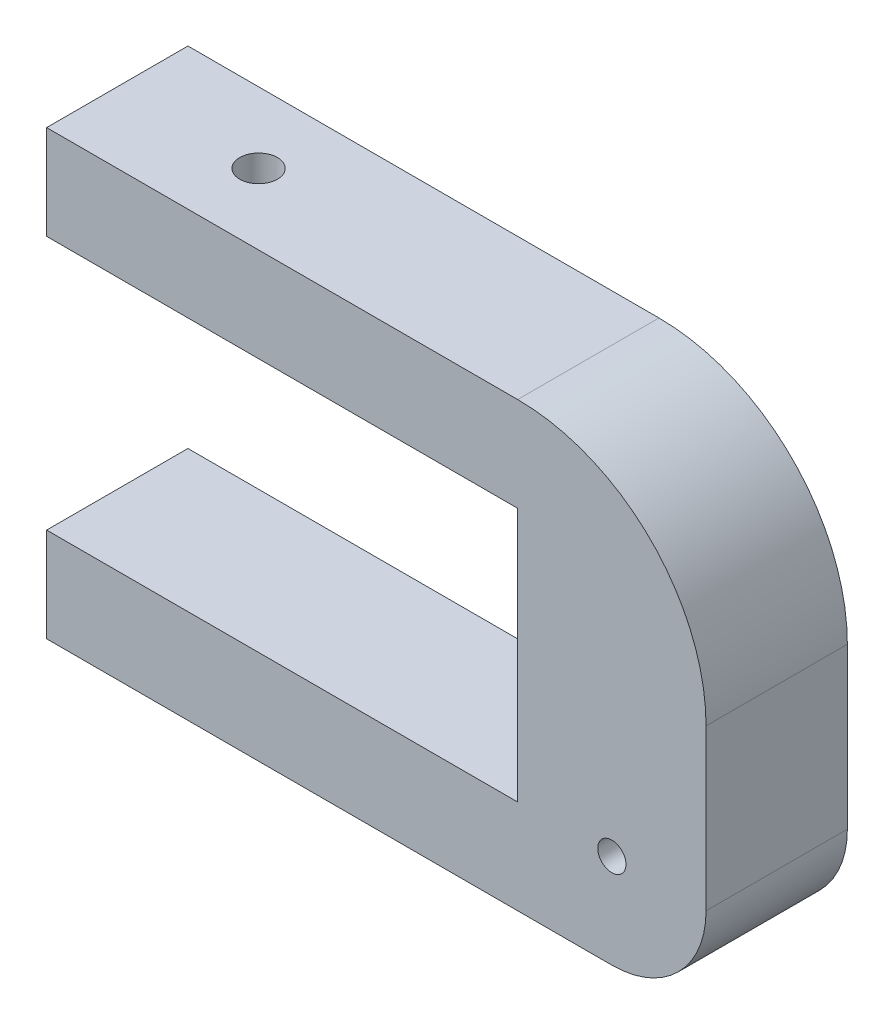
ISO-10303-21;
HEADER;
FILE_DESCRIPTION(('STEP AP214'),'2;1');
FILE_NAME('part.step','',(''),(''),'','','');
FILE_SCHEMA(('AUTOMOTIVE_DESIGN { 1 0 10303 214 1 1 1 1 }'));
ENDSEC;
DATA;
#1=APPLICATION_CONTEXT('core data for automotive mechanical design processes');
#2=APPLICATION_PROTOCOL_DEFINITION('international standard','automotive_design',2000,#1);
#3=PRODUCT_CONTEXT('',#1,'mechanical');
#4=PRODUCT('Part','Part','',(#3));
#5=PRODUCT_RELATED_PRODUCT_CATEGORY('part','',(#4));
#6=PRODUCT_DEFINITION_FORMATION('','',#4);
#7=PRODUCT_DEFINITION_CONTEXT('part definition',#1,'design');
#8=PRODUCT_DEFINITION('design','',#6,#7);
#9=PRODUCT_DEFINITION_SHAPE('','',#8);
#10=(LENGTH_UNIT() NAMED_UNIT(*) SI_UNIT(.MILLI.,.METRE.));
#11=(NAMED_UNIT(*) PLANE_ANGLE_UNIT() SI_UNIT($,.RADIAN.));
#12=(NAMED_UNIT(*) SI_UNIT($,.STERADIAN.) SOLID_ANGLE_UNIT());
#13=UNCERTAINTY_MEASURE_WITH_UNIT(LENGTH_MEASURE(1.E-05),#10,'distance_accuracy_value','');
#14=(GEOMETRIC_REPRESENTATION_CONTEXT(3) GLOBAL_UNCERTAINTY_ASSIGNED_CONTEXT((#13)) GLOBAL_UNIT_ASSIGNED_CONTEXT((#10,
#11,#12)) REPRESENTATION_CONTEXT('',''));
#15=CARTESIAN_POINT('',(0.,0.,0.));
#16=DIRECTION('',(0.,0.,1.));
#17=DIRECTION('',(1.,0.,0.));
#18=AXIS2_PLACEMENT_3D('',#15,#16,#17);
#19=CARTESIAN_POINT('',(50.,-20.,15.));
#20=DIRECTION('',(0.,0.,-1.));
#21=DIRECTION('',(-1.,0.,0.));
#22=AXIS2_PLACEMENT_3D('',#19,#20,#21);
#23=PLANE('',#22);
#24=DIRECTION('',(0.,-1.,0.));
#25=VECTOR('',#24,1.);
#26=CARTESIAN_POINT('',(0.,-10.,15.));
#27=LINE('',#26,#25);
#28=CARTESIAN_POINT('',(0.,0.,15.));
#29=VERTEX_POINT('',#28);
#30=CARTESIAN_POINT('',(0.,-10.,15.));
#31=VERTEX_POINT('',#30);
#32=EDGE_CURVE('E174',#29,#31,#27,.T.);
#33=ORIENTED_EDGE('',*,*,#32,.T.);
#34=DIRECTION('',(1.,0.,0.));
#35=VECTOR('',#34,1.);
#36=CARTESIAN_POINT('',(50.,-9.99999999999999,15.));
#37=LINE('',#36,#35);
#38=CARTESIAN_POINT('',(50.,-9.99999999999999,15.));
#39=VERTEX_POINT('',#38);
#40=EDGE_CURVE('E104',#31,#39,#37,.T.);
#41=ORIENTED_EDGE('',*,*,#40,.T.);
#42=DIRECTION('',(0.,-1.,0.));
#43=VECTOR('',#42,1.);
#44=CARTESIAN_POINT('',(50.,-37.,15.));
#45=LINE('',#44,#43);
#46=CARTESIAN_POINT('',(50.,-37.,15.));
#47=VERTEX_POINT('',#46);
#48=EDGE_CURVE('E196',#39,#47,#45,.T.);
#49=ORIENTED_EDGE('',*,*,#48,.T.);
#50=DIRECTION('',(-1.,0.,0.));
#51=VECTOR('',#50,1.);
#52=CARTESIAN_POINT('',(0.,-37.,15.));
#53=LINE('',#52,#51);
#54=CARTESIAN_POINT('',(0.,-37.,15.));
#55=VERTEX_POINT('',#54);
#56=EDGE_CURVE('E215',#47,#55,#53,.T.);
#57=ORIENTED_EDGE('',*,*,#56,.T.);
#58=DIRECTION('',(0.,-1.,0.));
#59=VECTOR('',#58,1.);
#60=CARTESIAN_POINT('',(0.,-47.,15.));
#61=LINE('',#60,#59);
#62=CARTESIAN_POINT('',(0.,-47.,15.));
#63=VERTEX_POINT('',#62);
#64=EDGE_CURVE('E212',#55,#63,#61,.T.);
#65=ORIENTED_EDGE('',*,*,#64,.T.);
#66=DIRECTION('',(1.,0.,0.));
#67=VECTOR('',#66,1.);
#68=CARTESIAN_POINT('',(0.,-47.,15.));
#69=LINE('',#68,#67);
#70=CARTESIAN_POINT('',(60.,-47.,15.));
#71=VERTEX_POINT('',#70);
#72=EDGE_CURVE('E214',#63,#71,#69,.T.);
#73=ORIENTED_EDGE('',*,*,#72,.T.);
#74=CARTESIAN_POINT('',(60.,-37.,15.));
#75=DIRECTION('',(0.,0.,1.));
#76=DIRECTION('',(-1.,0.,0.));
#77=AXIS2_PLACEMENT_3D('',#74,#75,#76);
#78=CIRCLE('',#77,10.);
#79=CARTESIAN_POINT('',(70.,-37.,15.));
#80=VERTEX_POINT('',#79);
#81=EDGE_CURVE('E133',#71,#80,#78,.T.);
#82=ORIENTED_EDGE('',*,*,#81,.T.);
#83=DIRECTION('',(0.,1.,0.));
#84=VECTOR('',#83,1.);
#85=CARTESIAN_POINT('',(70.,-20.,15.));
#86=LINE('',#85,#84);
#87=CARTESIAN_POINT('',(70.,-20.,15.));
#88=VERTEX_POINT('',#87);
#89=EDGE_CURVE('E126',#80,#88,#86,.T.);
#90=ORIENTED_EDGE('',*,*,#89,.T.);
#91=CARTESIAN_POINT('',(50.,-20.,15.));
#92=DIRECTION('',(0.,0.,1.));
#93=DIRECTION('',(-1.,0.,0.));
#94=AXIS2_PLACEMENT_3D('',#91,#92,#93);
#95=CIRCLE('',#94,20.);
#96=CARTESIAN_POINT('',(50.,0.,15.));
#97=VERTEX_POINT('',#96);
#98=EDGE_CURVE('E130',#88,#97,#95,.T.);
#99=ORIENTED_EDGE('',*,*,#98,.T.);
#100=DIRECTION('',(-1.,0.,0.));
#101=VECTOR('',#100,1.);
#102=CARTESIAN_POINT('',(0.,0.,15.));
#103=LINE('',#102,#101);
#104=EDGE_CURVE('E57',#97,#29,#103,.T.);
#105=ORIENTED_EDGE('',*,*,#104,.T.);
#106=EDGE_LOOP('',(#33,#41,#49,#57,#65,#73,#82,#90,#99,#105));
#107=FACE_BOUND('',#106,.T.);
#108=CARTESIAN_POINT('',(60.,-37.,15.));
#109=DIRECTION('',(0.,0.,1.));
#110=DIRECTION('',(1.,0.,0.));
#111=AXIS2_PLACEMENT_3D('',#108,#109,#110);
#112=CIRCLE('',#111,1.5);
#113=CARTESIAN_POINT('',(61.5,-37.,15.));
#114=VERTEX_POINT('',#113);
#115=EDGE_CURVE('E158',#114,#114,#112,.T.);
#116=ORIENTED_EDGE('',*,*,#115,.F.);
#117=EDGE_LOOP('',(#116));
#118=FACE_BOUND('',#117,.T.);
#119=ADVANCED_FACE('F32',(#107,#118),#23,.F.);
#120=CARTESIAN_POINT('',(50.,-20.,0.));
#121=DIRECTION('',(0.,0.,-1.));
#122=DIRECTION('',(-1.,0.,0.));
#123=AXIS2_PLACEMENT_3D('',#120,#121,#122);
#124=PLANE('',#123);
#125=DIRECTION('',(0.,-1.,0.));
#126=VECTOR('',#125,1.);
#127=CARTESIAN_POINT('',(0.,-10.,0.));
#128=LINE('',#127,#126);
#129=CARTESIAN_POINT('',(0.,0.,0.));
#130=VERTEX_POINT('',#129);
#131=CARTESIAN_POINT('',(0.,-10.,0.));
#132=VERTEX_POINT('',#131);
#133=EDGE_CURVE('E154',#130,#132,#128,.T.);
#134=ORIENTED_EDGE('',*,*,#133,.F.);
#135=DIRECTION('',(-1.,0.,0.));
#136=VECTOR('',#135,1.);
#137=CARTESIAN_POINT('',(0.,0.,0.));
#138=LINE('',#137,#136);
#139=CARTESIAN_POINT('',(50.,0.,0.));
#140=VERTEX_POINT('',#139);
#141=EDGE_CURVE('E96',#140,#130,#138,.T.);
#142=ORIENTED_EDGE('',*,*,#141,.F.);
#143=CARTESIAN_POINT('',(50.,-20.,0.));
#144=DIRECTION('',(0.,0.,1.));
#145=DIRECTION('',(-1.,0.,0.));
#146=AXIS2_PLACEMENT_3D('',#143,#144,#145);
#147=CIRCLE('',#146,20.);
#148=CARTESIAN_POINT('',(70.,-20.,0.));
#149=VERTEX_POINT('',#148);
#150=EDGE_CURVE('E171',#149,#140,#147,.T.);
#151=ORIENTED_EDGE('',*,*,#150,.F.);
#152=DIRECTION('',(0.,1.,0.));
#153=VECTOR('',#152,1.);
#154=CARTESIAN_POINT('',(70.,-20.,0.));
#155=LINE('',#154,#153);
#156=CARTESIAN_POINT('',(70.,-37.,0.));
#157=VERTEX_POINT('',#156);
#158=EDGE_CURVE('E142',#157,#149,#155,.T.);
#159=ORIENTED_EDGE('',*,*,#158,.F.);
#160=CARTESIAN_POINT('',(60.,-37.,0.));
#161=DIRECTION('',(0.,0.,1.));
#162=DIRECTION('',(-1.,0.,0.));
#163=AXIS2_PLACEMENT_3D('',#160,#161,#162);
#164=CIRCLE('',#163,10.);
#165=CARTESIAN_POINT('',(60.,-47.,0.));
#166=VERTEX_POINT('',#165);
#167=EDGE_CURVE('E168',#166,#157,#164,.T.);
#168=ORIENTED_EDGE('',*,*,#167,.F.);
#169=DIRECTION('',(1.,0.,0.));
#170=VECTOR('',#169,1.);
#171=CARTESIAN_POINT('',(0.,-47.,0.));
#172=LINE('',#171,#170);
#173=CARTESIAN_POINT('',(0.,-47.,0.));
#174=VERTEX_POINT('',#173);
#175=EDGE_CURVE('E166',#174,#166,#172,.T.);
#176=ORIENTED_EDGE('',*,*,#175,.F.);
#177=DIRECTION('',(0.,-1.,0.));
#178=VECTOR('',#177,1.);
#179=CARTESIAN_POINT('',(0.,-47.,0.));
#180=LINE('',#179,#178);
#181=CARTESIAN_POINT('',(0.,-37.,0.));
#182=VERTEX_POINT('',#181);
#183=EDGE_CURVE('E164',#182,#174,#180,.T.);
#184=ORIENTED_EDGE('',*,*,#183,.F.);
#185=DIRECTION('',(-1.,0.,0.));
#186=VECTOR('',#185,1.);
#187=CARTESIAN_POINT('',(0.,-37.,0.));
#188=LINE('',#187,#186);
#189=CARTESIAN_POINT('',(50.,-37.,0.));
#190=VERTEX_POINT('',#189);
#191=EDGE_CURVE('E162',#190,#182,#188,.T.);
#192=ORIENTED_EDGE('',*,*,#191,.F.);
#193=DIRECTION('',(0.,-1.,0.));
#194=VECTOR('',#193,1.);
#195=CARTESIAN_POINT('',(50.,-37.,0.));
#196=LINE('',#195,#194);
#197=CARTESIAN_POINT('',(50.,-9.99999999999999,0.));
#198=VERTEX_POINT('',#197);
#199=EDGE_CURVE('E160',#198,#190,#196,.T.);
#200=ORIENTED_EDGE('',*,*,#199,.F.);
#201=DIRECTION('',(1.,0.,0.));
#202=VECTOR('',#201,1.);
#203=CARTESIAN_POINT('',(50.,-9.99999999999999,0.));
#204=LINE('',#203,#202);
#205=EDGE_CURVE('E157',#132,#198,#204,.T.);
#206=ORIENTED_EDGE('',*,*,#205,.F.);
#207=EDGE_LOOP('',(#134,#142,#151,#159,#168,#176,#184,#192,#200,#206));
#208=FACE_BOUND('',#207,.T.);
#209=CARTESIAN_POINT('',(60.,-37.,0.));
#210=DIRECTION('',(0.,0.,1.));
#211=DIRECTION('',(1.,0.,0.));
#212=AXIS2_PLACEMENT_3D('',#209,#210,#211);
#213=CIRCLE('',#212,1.5);
#214=CARTESIAN_POINT('',(61.5,-37.,0.));
#215=VERTEX_POINT('',#214);
#216=EDGE_CURVE('E223',#215,#215,#213,.T.);
#217=ORIENTED_EDGE('',*,*,#216,.T.);
#218=EDGE_LOOP('',(#217));
#219=FACE_BOUND('',#218,.T.);
#220=ADVANCED_FACE('F200',(#208,#219),#124,.T.);
#221=CARTESIAN_POINT('',(0.,-10.,15.));
#222=DIRECTION('',(1.,0.,0.));
#223=DIRECTION('',(0.,0.,-1.));
#224=AXIS2_PLACEMENT_3D('',#221,#222,#223);
#225=PLANE('',#224);
#226=ORIENTED_EDGE('',*,*,#133,.T.);
#227=DIRECTION('',(0.,0.,-1.));
#228=VECTOR('',#227,1.);
#229=CARTESIAN_POINT('',(0.,-10.,15.));
#230=LINE('',#229,#228);
#231=EDGE_CURVE('E11',#31,#132,#230,.T.);
#232=ORIENTED_EDGE('',*,*,#231,.F.);
#233=ORIENTED_EDGE('',*,*,#32,.F.);
#234=DIRECTION('',(0.,0.,-1.));
#235=VECTOR('',#234,1.);
#236=CARTESIAN_POINT('',(0.,0.,15.));
#237=LINE('',#236,#235);
#238=EDGE_CURVE('E150',#29,#130,#237,.T.);
#239=ORIENTED_EDGE('',*,*,#238,.T.);
#240=EDGE_LOOP('',(#226,#232,#233,#239));
#241=FACE_BOUND('',#240,.T.);
#242=ADVANCED_FACE('F34',(#241),#225,.F.);
#243=CARTESIAN_POINT('',(50.,-9.99999999999999,15.));
#244=DIRECTION('',(0.,1.,0.));
#245=DIRECTION('',(-1.,0.,0.));
#246=AXIS2_PLACEMENT_3D('',#243,#244,#245);
#247=PLANE('',#246);
#248=CARTESIAN_POINT('',(15.,-10.,7.5));
#249=DIRECTION('',(0.,-1.,0.));
#250=DIRECTION('',(1.,0.,0.));
#251=AXIS2_PLACEMENT_3D('',#248,#249,#250);
#252=CIRCLE('',#251,5.);
#253=CARTESIAN_POINT('',(20.,-10.,7.5));
#254=VERTEX_POINT('',#253);
#255=EDGE_CURVE('E229',#254,#254,#252,.T.);
#256=ORIENTED_EDGE('',*,*,#255,.F.);
#257=EDGE_LOOP('',(#256));
#258=FACE_BOUND('',#257,.T.);
#259=ORIENTED_EDGE('',*,*,#205,.T.);
#260=DIRECTION('',(0.,0.,-1.));
#261=VECTOR('',#260,1.);
#262=CARTESIAN_POINT('',(50.,-9.99999999999999,15.));
#263=LINE('',#262,#261);
#264=EDGE_CURVE('E41',#39,#198,#263,.T.);
#265=ORIENTED_EDGE('',*,*,#264,.F.);
#266=ORIENTED_EDGE('',*,*,#40,.F.);
#267=ORIENTED_EDGE('',*,*,#231,.T.);
#268=EDGE_LOOP('',(#259,#265,#266,#267));
#269=FACE_BOUND('',#268,.T.);
#270=ADVANCED_FACE('F376',(#258,#269),#247,.F.);
#271=CARTESIAN_POINT('',(50.,-37.,15.));
#272=DIRECTION('',(1.,0.,0.));
#273=DIRECTION('',(0.,0.,-1.));
#274=AXIS2_PLACEMENT_3D('',#271,#272,#273);
#275=PLANE('',#274);
#276=ORIENTED_EDGE('',*,*,#199,.T.);
#277=DIRECTION('',(0.,0.,-1.));
#278=VECTOR('',#277,1.);
#279=CARTESIAN_POINT('',(50.,-37.,15.));
#280=LINE('',#279,#278);
#281=EDGE_CURVE('E187',#47,#190,#280,.T.);
#282=ORIENTED_EDGE('',*,*,#281,.F.);
#283=ORIENTED_EDGE('',*,*,#48,.F.);
#284=ORIENTED_EDGE('',*,*,#264,.T.);
#285=EDGE_LOOP('',(#276,#282,#283,#284));
#286=FACE_BOUND('',#285,.T.);
#287=ADVANCED_FACE('F194',(#286),#275,.F.);
#288=CARTESIAN_POINT('',(0.,-37.,15.));
#289=DIRECTION('',(0.,-1.,0.));
#290=DIRECTION('',(0.,0.,-1.));
#291=AXIS2_PLACEMENT_3D('',#288,#289,#290);
#292=PLANE('',#291);
#293=ORIENTED_EDGE('',*,*,#191,.T.);
#294=DIRECTION('',(0.,0.,-1.));
#295=VECTOR('',#294,1.);
#296=CARTESIAN_POINT('',(0.,-37.,15.));
#297=LINE('',#296,#295);
#298=EDGE_CURVE('E184',#55,#182,#297,.T.);
#299=ORIENTED_EDGE('',*,*,#298,.F.);
#300=ORIENTED_EDGE('',*,*,#56,.F.);
#301=ORIENTED_EDGE('',*,*,#281,.T.);
#302=EDGE_LOOP('',(#293,#299,#300,#301));
#303=FACE_BOUND('',#302,.T.);
#304=ADVANCED_FACE('F206',(#303),#292,.F.);
#305=CARTESIAN_POINT('',(0.,-47.,15.));
#306=DIRECTION('',(1.,0.,0.));
#307=DIRECTION('',(0.,0.,-1.));
#308=AXIS2_PLACEMENT_3D('',#305,#306,#307);
#309=PLANE('',#308);
#310=ORIENTED_EDGE('',*,*,#183,.T.);
#311=DIRECTION('',(0.,0.,-1.));
#312=VECTOR('',#311,1.);
#313=CARTESIAN_POINT('',(0.,-47.,15.));
#314=LINE('',#313,#312);
#315=EDGE_CURVE('E181',#63,#174,#314,.T.);
#316=ORIENTED_EDGE('',*,*,#315,.F.);
#317=ORIENTED_EDGE('',*,*,#64,.F.);
#318=ORIENTED_EDGE('',*,*,#298,.T.);
#319=EDGE_LOOP('',(#310,#316,#317,#318));
#320=FACE_BOUND('',#319,.T.);
#321=ADVANCED_FACE('F210',(#320),#309,.F.);
#322=CARTESIAN_POINT('',(0.,-47.,15.));
#323=DIRECTION('',(0.,1.,0.));
#324=DIRECTION('',(0.,0.,1.));
#325=AXIS2_PLACEMENT_3D('',#322,#323,#324);
#326=PLANE('',#325);
#327=ORIENTED_EDGE('',*,*,#175,.T.);
#328=DIRECTION('',(0.,0.,-1.));
#329=VECTOR('',#328,1.);
#330=CARTESIAN_POINT('',(60.,-47.,15.));
#331=LINE('',#330,#329);
#332=EDGE_CURVE('E178',#71,#166,#331,.T.);
#333=ORIENTED_EDGE('',*,*,#332,.F.);
#334=ORIENTED_EDGE('',*,*,#72,.F.);
#335=ORIENTED_EDGE('',*,*,#315,.T.);
#336=EDGE_LOOP('',(#327,#333,#334,#335));
#337=FACE_BOUND('',#336,.T.);
#338=ADVANCED_FACE('F366',(#337),#326,.F.);
#339=CARTESIAN_POINT('',(60.,-37.,15.));
#340=DIRECTION('',(0.,0.,-1.));
#341=DIRECTION('',(-1.,0.,0.));
#342=AXIS2_PLACEMENT_3D('',#339,#340,#341);
#343=CYLINDRICAL_SURFACE('',#342,10.);
#344=ORIENTED_EDGE('',*,*,#167,.T.);
#345=DIRECTION('',(0.,0.,-1.));
#346=VECTOR('',#345,1.);
#347=CARTESIAN_POINT('',(70.,-37.,15.));
#348=LINE('',#347,#346);
#349=EDGE_CURVE('E145',#80,#157,#348,.T.);
#350=ORIENTED_EDGE('',*,*,#349,.F.);
#351=ORIENTED_EDGE('',*,*,#81,.F.);
#352=ORIENTED_EDGE('',*,*,#332,.T.);
#353=EDGE_LOOP('',(#344,#350,#351,#352));
#354=FACE_BOUND('',#353,.T.);
#355=ADVANCED_FACE('F363',(#354),#343,.T.);
#356=CARTESIAN_POINT('',(70.,-20.,15.));
#357=DIRECTION('',(-1.,0.,0.));
#358=DIRECTION('',(0.,0.,1.));
#359=AXIS2_PLACEMENT_3D('',#356,#357,#358);
#360=PLANE('',#359);
#361=ORIENTED_EDGE('',*,*,#158,.T.);
#362=DIRECTION('',(0.,0.,-1.));
#363=VECTOR('',#362,1.);
#364=CARTESIAN_POINT('',(70.,-20.,15.));
#365=LINE('',#364,#363);
#366=EDGE_CURVE('E139',#88,#149,#365,.T.);
#367=ORIENTED_EDGE('',*,*,#366,.F.);
#368=ORIENTED_EDGE('',*,*,#89,.F.);
#369=ORIENTED_EDGE('',*,*,#349,.T.);
#370=EDGE_LOOP('',(#361,#367,#368,#369));
#371=FACE_BOUND('',#370,.T.);
#372=ADVANCED_FACE('F140',(#371),#360,.F.);
#373=CARTESIAN_POINT('',(50.,-20.,15.));
#374=DIRECTION('',(0.,0.,-1.));
#375=DIRECTION('',(-1.,0.,0.));
#376=AXIS2_PLACEMENT_3D('',#373,#374,#375);
#377=CYLINDRICAL_SURFACE('',#376,20.);
#378=ORIENTED_EDGE('',*,*,#150,.T.);
#379=DIRECTION('',(0.,0.,-1.));
#380=VECTOR('',#379,1.);
#381=CARTESIAN_POINT('',(50.,0.,15.));
#382=LINE('',#381,#380);
#383=EDGE_CURVE('E146',#97,#140,#382,.T.);
#384=ORIENTED_EDGE('',*,*,#383,.F.);
#385=ORIENTED_EDGE('',*,*,#98,.F.);
#386=ORIENTED_EDGE('',*,*,#366,.T.);
#387=EDGE_LOOP('',(#378,#384,#385,#386));
#388=FACE_BOUND('',#387,.T.);
#389=ADVANCED_FACE('F148',(#388),#377,.T.);
#390=CARTESIAN_POINT('',(0.,0.,15.));
#391=DIRECTION('',(0.,-1.,0.));
#392=DIRECTION('',(0.,0.,-1.));
#393=AXIS2_PLACEMENT_3D('',#390,#391,#392);
#394=PLANE('',#393);
#395=CARTESIAN_POINT('',(15.,0.,7.5));
#396=DIRECTION('',(0.,-1.,0.));
#397=DIRECTION('',(1.,0.,0.));
#398=AXIS2_PLACEMENT_3D('',#395,#396,#397);
#399=CIRCLE('',#398,2.);
#400=CARTESIAN_POINT('',(17.,0.,7.5));
#401=VERTEX_POINT('',#400);
#402=EDGE_CURVE('E232',#401,#401,#399,.T.);
#403=ORIENTED_EDGE('',*,*,#402,.T.);
#404=EDGE_LOOP('',(#403));
#405=FACE_BOUND('',#404,.T.);
#406=ORIENTED_EDGE('',*,*,#141,.T.);
#407=ORIENTED_EDGE('',*,*,#238,.F.);
#408=ORIENTED_EDGE('',*,*,#104,.F.);
#409=ORIENTED_EDGE('',*,*,#383,.T.);
#410=EDGE_LOOP('',(#406,#407,#408,#409));
#411=FACE_BOUND('',#410,.T.);
#412=ADVANCED_FACE('F355',(#405,#411),#394,.F.);
#413=CARTESIAN_POINT('',(60.,-37.,15.));
#414=DIRECTION('',(0.,0.,-1.));
#415=DIRECTION('',(-1.,0.,0.));
#416=AXIS2_PLACEMENT_3D('',#413,#414,#415);
#417=CYLINDRICAL_SURFACE('',#416,1.5);
#418=ORIENTED_EDGE('',*,*,#115,.T.);
#419=EDGE_LOOP('',(#418));
#420=FACE_BOUND('',#419,.T.);
#421=ORIENTED_EDGE('',*,*,#216,.F.);
#422=EDGE_LOOP('',(#421));
#423=FACE_BOUND('',#422,.T.);
#424=ADVANCED_FACE('F352',(#420,#423),#417,.F.);
#425=CARTESIAN_POINT('',(15.,-8.00000000000002,7.5));
#426=DIRECTION('',(0.,-1.,0.));
#427=DIRECTION('',(1.,0.,0.));
#428=AXIS2_PLACEMENT_3D('',#425,#426,#427);
#429=CYLINDRICAL_SURFACE('',#428,5.);
#430=CARTESIAN_POINT('',(15.,-8.00000000000002,7.5));
#431=DIRECTION('',(0.,-1.,0.));
#432=DIRECTION('',(1.,0.,0.));
#433=AXIS2_PLACEMENT_3D('',#430,#431,#432);
#434=CIRCLE('',#433,5.);
#435=CARTESIAN_POINT('',(20.,-8.00000000000002,7.5));
#436=VERTEX_POINT('',#435);
#437=EDGE_CURVE('E226',#436,#436,#434,.T.);
#438=ORIENTED_EDGE('',*,*,#437,.F.);
#439=EDGE_LOOP('',(#438));
#440=FACE_BOUND('',#439,.T.);
#441=ORIENTED_EDGE('',*,*,#255,.T.);
#442=EDGE_LOOP('',(#441));
#443=FACE_BOUND('',#442,.T.);
#444=ADVANCED_FACE('F389',(#440,#443),#429,.F.);
#445=CARTESIAN_POINT('',(15.,-8.00000000000002,7.5));
#446=DIRECTION('',(0.,-1.,0.));
#447=DIRECTION('',(1.,0.,0.));
#448=AXIS2_PLACEMENT_3D('',#445,#446,#447);
#449=PLANE('',#448);
#450=DIRECTION('',(0.866025403784439,0.,-0.5));
#451=VECTOR('',#450,1.);
#452=CARTESIAN_POINT('',(15.,-8.00000000000002,4.61324865405184));
#453=LINE('',#452,#451);
#454=CARTESIAN_POINT('',(12.5,-8.00000000000002,6.05662432702592));
#455=VERTEX_POINT('',#454);
#456=CARTESIAN_POINT('',(15.,-8.00000000000002,4.61324865405185));
#457=VERTEX_POINT('',#456);
#458=EDGE_CURVE('E48',#455,#457,#453,.T.);
#459=ORIENTED_EDGE('',*,*,#458,.F.);
#460=DIRECTION('',(0.,0.,-1.));
#461=VECTOR('',#460,1.);
#462=CARTESIAN_POINT('',(12.5,-8.00000000000002,6.05662432702592));
#463=LINE('',#462,#461);
#464=CARTESIAN_POINT('',(12.5,-8.00000000000002,8.94337567297408));
#465=VERTEX_POINT('',#464);
#466=EDGE_CURVE('E254',#465,#455,#463,.T.);
#467=ORIENTED_EDGE('',*,*,#466,.F.);
#468=DIRECTION('',(-0.866025403784439,0.,-0.499999999999999));
#469=VECTOR('',#468,1.);
#470=CARTESIAN_POINT('',(12.5,-8.00000000000002,8.94337567297408));
#471=LINE('',#470,#469);
#472=CARTESIAN_POINT('',(15.,-8.00000000000002,10.3867513459482));
#473=VERTEX_POINT('',#472);
#474=EDGE_CURVE('E258',#473,#465,#471,.T.);
#475=ORIENTED_EDGE('',*,*,#474,.F.);
#476=DIRECTION('',(-0.866025403784439,0.,0.499999999999998));
#477=VECTOR('',#476,1.);
#478=CARTESIAN_POINT('',(15.,-8.00000000000002,10.3867513459482));
#479=LINE('',#478,#477);
#480=CARTESIAN_POINT('',(17.5,-8.00000000000002,8.94337567297408));
#481=VERTEX_POINT('',#480);
#482=EDGE_CURVE('E261',#481,#473,#479,.T.);
#483=ORIENTED_EDGE('',*,*,#482,.F.);
#484=DIRECTION('',(0.,0.,1.));
#485=VECTOR('',#484,1.);
#486=CARTESIAN_POINT('',(17.5,-8.00000000000002,8.94337567297408));
#487=LINE('',#486,#485);
#488=CARTESIAN_POINT('',(17.5,-8.00000000000002,6.05662432702592));
#489=VERTEX_POINT('',#488);
#490=EDGE_CURVE('E264',#489,#481,#487,.T.);
#491=ORIENTED_EDGE('',*,*,#490,.F.);
#492=DIRECTION('',(0.866025403784439,0.,0.499999999999999));
#493=VECTOR('',#492,1.);
#494=CARTESIAN_POINT('',(17.5,-8.00000000000002,6.05662432702592));
#495=LINE('',#494,#493);
#496=EDGE_CURVE('E267',#457,#489,#495,.T.);
#497=ORIENTED_EDGE('',*,*,#496,.F.);
#498=EDGE_LOOP('',(#459,#467,#475,#483,#491,#497));
#499=FACE_BOUND('',#498,.T.);
#500=ORIENTED_EDGE('',*,*,#437,.T.);
#501=EDGE_LOOP('',(#500));
#502=FACE_BOUND('',#501,.T.);
#503=ADVANCED_FACE('F320',(#499,#502),#449,.T.);
#504=CARTESIAN_POINT('',(15.,0.,7.5));
#505=DIRECTION('',(0.,-1.,0.));
#506=DIRECTION('',(1.,0.,0.));
#507=AXIS2_PLACEMENT_3D('',#504,#505,#506);
#508=CYLINDRICAL_SURFACE('',#507,2.);
#509=CARTESIAN_POINT('',(15.,-5.50000000000002,7.5));
#510=DIRECTION('',(0.,1.,0.));
#511=DIRECTION('',(0.,0.,1.));
#512=AXIS2_PLACEMENT_3D('',#509,#510,#511);
#513=CIRCLE('',#512,2.);
#514=CARTESIAN_POINT('',(15.,-5.50000000000002,9.5));
#515=VERTEX_POINT('',#514);
#516=EDGE_CURVE('E36',#515,#515,#513,.F.);
#517=ORIENTED_EDGE('',*,*,#516,.T.);
#518=EDGE_LOOP('',(#517));
#519=FACE_BOUND('',#518,.T.);
#520=ORIENTED_EDGE('',*,*,#402,.F.);
#521=EDGE_LOOP('',(#520));
#522=FACE_BOUND('',#521,.T.);
#523=ADVANCED_FACE('F396',(#519,#522),#508,.F.);
#524=CARTESIAN_POINT('',(0.,-5.50000000000002,0.));
#525=DIRECTION('',(0.,1.,0.));
#526=DIRECTION('',(0.,0.,1.));
#527=AXIS2_PLACEMENT_3D('',#524,#525,#526);
#528=PLANE('',#527);
#529=DIRECTION('',(0.866025403784439,0.,-0.5));
#530=VECTOR('',#529,1.);
#531=CARTESIAN_POINT('',(15.,-5.50000000000002,4.61324865405184));
#532=LINE('',#531,#530);
#533=CARTESIAN_POINT('',(12.5,-5.50000000000002,6.05662432702592));
#534=VERTEX_POINT('',#533);
#535=CARTESIAN_POINT('',(15.,-5.50000000000002,4.61324865405184));
#536=VERTEX_POINT('',#535);
#537=EDGE_CURVE('E257',#534,#536,#532,.T.);
#538=ORIENTED_EDGE('',*,*,#537,.T.);
#539=DIRECTION('',(0.866025403784439,0.,0.499999999999999));
#540=VECTOR('',#539,1.);
#541=CARTESIAN_POINT('',(17.5,-5.50000000000002,6.05662432702592));
#542=LINE('',#541,#540);
#543=CARTESIAN_POINT('',(17.5,-5.50000000000002,6.05662432702592));
#544=VERTEX_POINT('',#543);
#545=EDGE_CURVE('E282',#536,#544,#542,.T.);
#546=ORIENTED_EDGE('',*,*,#545,.T.);
#547=DIRECTION('',(0.,0.,1.));
#548=VECTOR('',#547,1.);
#549=CARTESIAN_POINT('',(17.5,-5.50000000000002,8.94337567297408));
#550=LINE('',#549,#548);
#551=CARTESIAN_POINT('',(17.5,-5.50000000000002,8.94337567297408));
#552=VERTEX_POINT('',#551);
#553=EDGE_CURVE('E279',#544,#552,#550,.T.);
#554=ORIENTED_EDGE('',*,*,#553,.T.);
#555=DIRECTION('',(-0.866025403784439,0.,0.499999999999998));
#556=VECTOR('',#555,1.);
#557=CARTESIAN_POINT('',(15.,-5.50000000000002,10.3867513459482));
#558=LINE('',#557,#556);
#559=CARTESIAN_POINT('',(15.,-5.50000000000002,10.3867513459482));
#560=VERTEX_POINT('',#559);
#561=EDGE_CURVE('E276',#552,#560,#558,.T.);
#562=ORIENTED_EDGE('',*,*,#561,.T.);
#563=DIRECTION('',(-0.866025403784439,0.,-0.499999999999999));
#564=VECTOR('',#563,1.);
#565=CARTESIAN_POINT('',(12.5,-5.50000000000002,8.94337567297408));
#566=LINE('',#565,#564);
#567=CARTESIAN_POINT('',(12.5,-5.50000000000002,8.94337567297408));
#568=VERTEX_POINT('',#567);
#569=EDGE_CURVE('E273',#560,#568,#566,.T.);
#570=ORIENTED_EDGE('',*,*,#569,.T.);
#571=DIRECTION('',(0.,0.,-1.));
#572=VECTOR('',#571,1.);
#573=CARTESIAN_POINT('',(12.5,-5.50000000000002,6.05662432702592));
#574=LINE('',#573,#572);
#575=EDGE_CURVE('E240',#568,#534,#574,.T.);
#576=ORIENTED_EDGE('',*,*,#575,.T.);
#577=EDGE_LOOP('',(#538,#546,#554,#562,#570,#576));
#578=FACE_BOUND('',#577,.T.);
#579=ORIENTED_EDGE('',*,*,#516,.F.);
#580=EDGE_LOOP('',(#579));
#581=FACE_BOUND('',#580,.T.);
#582=ADVANCED_FACE('F289',(#578,#581),#528,.F.);
#583=CARTESIAN_POINT('',(15.,-5.50000000000002,4.61324865405184));
#584=DIRECTION('',(-0.5,0.,-0.866025403784439));
#585=DIRECTION('',(-0.866025403784439,0.,0.5));
#586=AXIS2_PLACEMENT_3D('',#583,#584,#585);
#587=PLANE('',#586);
#588=ORIENTED_EDGE('',*,*,#458,.T.);
#589=DIRECTION('',(0.,-1.,0.));
#590=VECTOR('',#589,1.);
#591=CARTESIAN_POINT('',(15.,-5.50000000000002,4.61324865405184));
#592=LINE('',#591,#590);
#593=EDGE_CURVE('E237',#536,#457,#592,.T.);
#594=ORIENTED_EDGE('',*,*,#593,.F.);
#595=ORIENTED_EDGE('',*,*,#537,.F.);
#596=DIRECTION('',(0.,-1.,0.));
#597=VECTOR('',#596,1.);
#598=CARTESIAN_POINT('',(12.5,-5.50000000000002,6.05662432702592));
#599=LINE('',#598,#597);
#600=EDGE_CURVE('E252',#534,#455,#599,.T.);
#601=ORIENTED_EDGE('',*,*,#600,.T.);
#602=EDGE_LOOP('',(#588,#594,#595,#601));
#603=FACE_BOUND('',#602,.T.);
#604=ADVANCED_FACE('F295',(#603),#587,.F.);
#605=CARTESIAN_POINT('',(12.5,-5.50000000000002,6.05662432702592));
#606=DIRECTION('',(-1.,0.,0.));
#607=DIRECTION('',(0.,-1.,0.));
#608=AXIS2_PLACEMENT_3D('',#605,#606,#607);
#609=PLANE('',#608);
#610=ORIENTED_EDGE('',*,*,#466,.T.);
#611=ORIENTED_EDGE('',*,*,#600,.F.);
#612=ORIENTED_EDGE('',*,*,#575,.F.);
#613=DIRECTION('',(0.,-1.,0.));
#614=VECTOR('',#613,1.);
#615=CARTESIAN_POINT('',(12.5,-5.50000000000002,8.94337567297408));
#616=LINE('',#615,#614);
#617=EDGE_CURVE('E249',#568,#465,#616,.T.);
#618=ORIENTED_EDGE('',*,*,#617,.T.);
#619=EDGE_LOOP('',(#610,#611,#612,#618));
#620=FACE_BOUND('',#619,.T.);
#621=ADVANCED_FACE('F311',(#620),#609,.F.);
#622=CARTESIAN_POINT('',(12.5,-5.50000000000002,8.94337567297408));
#623=DIRECTION('',(-0.499999999999999,0.,0.866025403784439));
#624=DIRECTION('',(0.866025403784439,0.,0.499999999999999));
#625=AXIS2_PLACEMENT_3D('',#622,#623,#624);
#626=PLANE('',#625);
#627=ORIENTED_EDGE('',*,*,#474,.T.);
#628=ORIENTED_EDGE('',*,*,#617,.F.);
#629=ORIENTED_EDGE('',*,*,#569,.F.);
#630=DIRECTION('',(0.,-1.,0.));
#631=VECTOR('',#630,1.);
#632=CARTESIAN_POINT('',(15.,-5.50000000000002,10.3867513459482));
#633=LINE('',#632,#631);
#634=EDGE_CURVE('E246',#560,#473,#633,.T.);
#635=ORIENTED_EDGE('',*,*,#634,.T.);
#636=EDGE_LOOP('',(#627,#628,#629,#635));
#637=FACE_BOUND('',#636,.T.);
#638=ADVANCED_FACE('F316',(#637),#626,.F.);
#639=CARTESIAN_POINT('',(15.,-5.50000000000002,10.3867513459482));
#640=DIRECTION('',(0.499999999999998,0.,0.866025403784439));
#641=DIRECTION('',(0.86602540378444,0.,-0.499999999999998));
#642=AXIS2_PLACEMENT_3D('',#639,#640,#641);
#643=PLANE('',#642);
#644=ORIENTED_EDGE('',*,*,#482,.T.);
#645=ORIENTED_EDGE('',*,*,#634,.F.);
#646=ORIENTED_EDGE('',*,*,#561,.F.);
#647=DIRECTION('',(0.,-1.,0.));
#648=VECTOR('',#647,1.);
#649=CARTESIAN_POINT('',(17.5,-5.50000000000002,8.94337567297408));
#650=LINE('',#649,#648);
#651=EDGE_CURVE('E243',#552,#481,#650,.T.);
#652=ORIENTED_EDGE('',*,*,#651,.T.);
#653=EDGE_LOOP('',(#644,#645,#646,#652));
#654=FACE_BOUND('',#653,.T.);
#655=ADVANCED_FACE('F336',(#654),#643,.F.);
#656=CARTESIAN_POINT('',(17.5,-5.50000000000002,8.94337567297408));
#657=DIRECTION('',(1.,0.,0.));
#658=DIRECTION('',(0.,1.,0.));
#659=AXIS2_PLACEMENT_3D('',#656,#657,#658);
#660=PLANE('',#659);
#661=ORIENTED_EDGE('',*,*,#490,.T.);
#662=ORIENTED_EDGE('',*,*,#651,.F.);
#663=ORIENTED_EDGE('',*,*,#553,.F.);
#664=DIRECTION('',(0.,-1.,0.));
#665=VECTOR('',#664,1.);
#666=CARTESIAN_POINT('',(17.5,-5.50000000000002,6.05662432702592));
#667=LINE('',#666,#665);
#668=EDGE_CURVE('E239',#544,#489,#667,.T.);
#669=ORIENTED_EDGE('',*,*,#668,.T.);
#670=EDGE_LOOP('',(#661,#662,#663,#669));
#671=FACE_BOUND('',#670,.T.);
#672=ADVANCED_FACE('F332',(#671),#660,.F.);
#673=CARTESIAN_POINT('',(17.5,-5.50000000000002,6.05662432702592));
#674=DIRECTION('',(0.499999999999999,0.,-0.866025403784439));
#675=DIRECTION('',(-0.866025403784439,0.,-0.499999999999999));
#676=AXIS2_PLACEMENT_3D('',#673,#674,#675);
#677=PLANE('',#676);
#678=ORIENTED_EDGE('',*,*,#496,.T.);
#679=ORIENTED_EDGE('',*,*,#668,.F.);
#680=ORIENTED_EDGE('',*,*,#545,.F.);
#681=ORIENTED_EDGE('',*,*,#593,.T.);
#682=EDGE_LOOP('',(#678,#679,#680,#681));
#683=FACE_BOUND('',#682,.T.);
#684=ADVANCED_FACE('F326',(#683),#677,.F.);
#685=CLOSED_SHELL('',(#119,#220,#242,#270,#287,#304,#321,#338,#355,#372,#389,#412,#424,#444,
#503,#523,#582,#604,#621,#638,#655,#672,#684));
#686=MANIFOLD_SOLID_BREP('B2',#685);
#687=ADVANCED_BREP_SHAPE_REPRESENTATION('',(#18,#686),#14);
#688=SHAPE_DEFINITION_REPRESENTATION(#9,#687);
ENDSEC;
END-ISO-10303-21;
